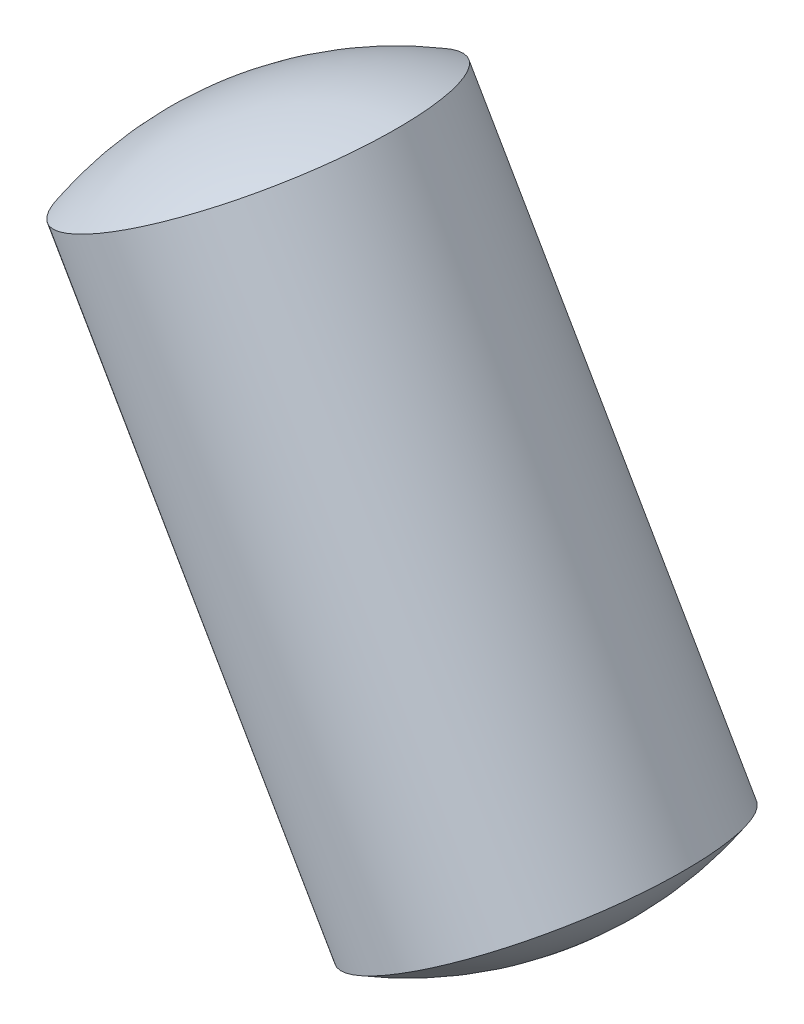
ISO-10303-21;
HEADER;
FILE_DESCRIPTION(('STEP AP214'),'2;1');
FILE_NAME('part.step','',(''),(''),'','','');
FILE_SCHEMA(('AUTOMOTIVE_DESIGN { 1 0 10303 214 1 1 1 1 }'));
ENDSEC;
DATA;
#1=APPLICATION_CONTEXT('core data for automotive mechanical design processes');
#2=APPLICATION_PROTOCOL_DEFINITION('international standard','automotive_design',2000,#1);
#3=PRODUCT_CONTEXT('',#1,'mechanical');
#4=PRODUCT('Part','Part','',(#3));
#5=PRODUCT_RELATED_PRODUCT_CATEGORY('part','',(#4));
#6=PRODUCT_DEFINITION_FORMATION('','',#4);
#7=PRODUCT_DEFINITION_CONTEXT('part definition',#1,'design');
#8=PRODUCT_DEFINITION('design','',#6,#7);
#9=PRODUCT_DEFINITION_SHAPE('','',#8);
#10=(LENGTH_UNIT() NAMED_UNIT(*) SI_UNIT(.MILLI.,.METRE.));
#11=(NAMED_UNIT(*) PLANE_ANGLE_UNIT() SI_UNIT($,.RADIAN.));
#12=(NAMED_UNIT(*) SI_UNIT($,.STERADIAN.) SOLID_ANGLE_UNIT());
#13=UNCERTAINTY_MEASURE_WITH_UNIT(LENGTH_MEASURE(1.E-05),#10,'distance_accuracy_value','');
#14=(GEOMETRIC_REPRESENTATION_CONTEXT(3) GLOBAL_UNCERTAINTY_ASSIGNED_CONTEXT((#13)) GLOBAL_UNIT_ASSIGNED_CONTEXT((#10,
#11,#12)) REPRESENTATION_CONTEXT('',''));
#15=CARTESIAN_POINT('',(0.,0.,0.));
#16=DIRECTION('',(0.,0.,1.));
#17=DIRECTION('',(1.,0.,0.));
#18=AXIS2_PLACEMENT_3D('',#15,#16,#17);
#19=CARTESIAN_POINT('',(-13.8009618943234,23.90396719429,0.9));
#20=DIRECTION('',(0.866025403784439,0.5,0.));
#21=DIRECTION('',(-0.5,0.866025403784439,0.));
#22=AXIS2_PLACEMENT_3D('',#19,#20,#21);
#23=SPHERICAL_SURFACE('',#22,3.);
#24=CARTESIAN_POINT('',(-13.8009618943234,23.90396719429,0.9));
#25=DIRECTION('',(0.5,-0.866025403784439,0.));
#26=DIRECTION('',(0.,0.,-1.));
#27=AXIS2_PLACEMENT_3D('',#24,#25,#26);
#28=SPHERICAL_SURFACE('',#27,3.);
#29=CARTESIAN_POINT('',(-15.1,26.15396719429,0.9));
#30=DIRECTION('',(0.5,-0.866025403784439,0.));
#31=DIRECTION('',(0.,0.,-1.));
#32=AXIS2_PLACEMENT_3D('',#29,#30,#31);
#33=CIRCLE('',#32,1.5);
#34=CARTESIAN_POINT('',(-15.1,26.15396719429,-0.6));
#35=VERTEX_POINT('',#34);
#36=EDGE_CURVE('E11',#35,#35,#33,.T.);
#37=ORIENTED_EDGE('',*,*,#36,.F.);
#38=EDGE_LOOP('',(#37));
#39=FACE_BOUND('',#38,.T.);
#40=ADVANCED_FACE('F17',(#39),#28,.T.);
#41=CARTESIAN_POINT('',(-13.6990381056767,23.7274300138542,0.9));
#42=DIRECTION('',(0.866025403784439,0.5,0.));
#43=DIRECTION('',(0.5,-0.866025403784439,0.));
#44=AXIS2_PLACEMENT_3D('',#41,#42,#43);
#45=SPHERICAL_SURFACE('',#44,3.);
#46=CARTESIAN_POINT('',(-13.6990381056767,23.7274300138542,0.9));
#47=DIRECTION('',(0.5,-0.866025403784439,0.));
#48=DIRECTION('',(0.,0.,-1.));
#49=AXIS2_PLACEMENT_3D('',#46,#47,#48);
#50=SPHERICAL_SURFACE('',#49,3.);
#51=CARTESIAN_POINT('',(-12.4,21.477430013854,0.9));
#52=DIRECTION('',(0.5,-0.866025403784439,0.));
#53=DIRECTION('',(0.,0.,-1.));
#54=AXIS2_PLACEMENT_3D('',#51,#52,#53);
#55=CIRCLE('',#54,1.5);
#56=CARTESIAN_POINT('',(-12.4,21.477430013854,-0.6));
#57=VERTEX_POINT('',#56);
#58=EDGE_CURVE('E21',#57,#57,#55,.T.);
#59=ORIENTED_EDGE('',*,*,#58,.T.);
#60=EDGE_LOOP('',(#59));
#61=FACE_BOUND('',#60,.T.);
#62=ADVANCED_FACE('F40',(#61),#50,.T.);
#63=CARTESIAN_POINT('',(-13.075,22.6465643089631,0.9));
#64=DIRECTION('',(0.5,-0.866025403784439,0.));
#65=DIRECTION('',(0.,0.,-1.));
#66=AXIS2_PLACEMENT_3D('',#63,#64,#65);
#67=CYLINDRICAL_SURFACE('',#66,1.5);
#68=ORIENTED_EDGE('',*,*,#36,.T.);
#69=EDGE_LOOP('',(#68));
#70=FACE_BOUND('',#69,.T.);
#71=ORIENTED_EDGE('',*,*,#58,.F.);
#72=EDGE_LOOP('',(#71));
#73=FACE_BOUND('',#72,.T.);
#74=ADVANCED_FACE('F19',(#70,#73),#67,.T.);
#75=CLOSED_SHELL('',(#40,#62,#74));
#76=MANIFOLD_SOLID_BREP('B1',#75);
#77=ADVANCED_BREP_SHAPE_REPRESENTATION('',(#18,#76),#14);
#78=SHAPE_DEFINITION_REPRESENTATION(#9,#77);
ENDSEC;
END-ISO-10303-21;
